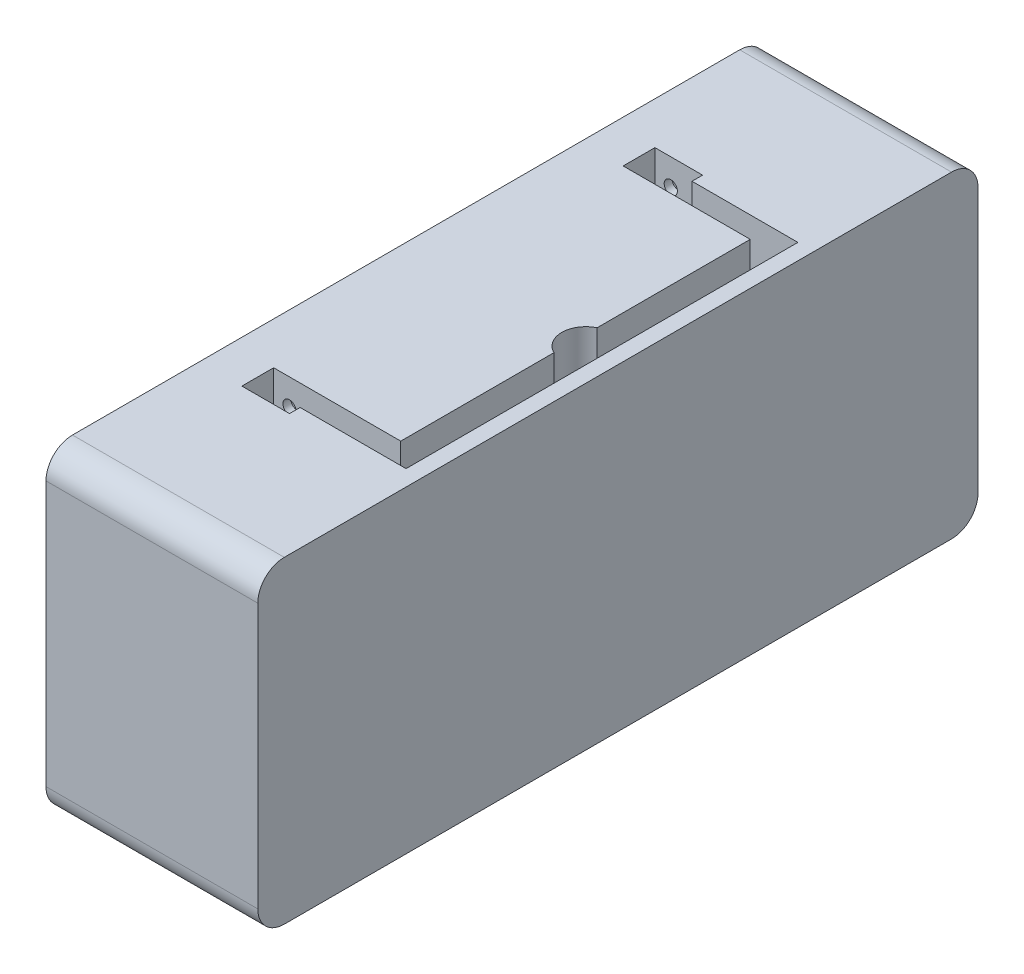
ISO-10303-21;
HEADER;
FILE_DESCRIPTION(('STEP AP214'),'2;1');
FILE_NAME('part.step','',(''),(''),'','','');
FILE_SCHEMA(('AUTOMOTIVE_DESIGN { 1 0 10303 214 1 1 1 1 }'));
ENDSEC;
DATA;
#1=APPLICATION_CONTEXT('core data for automotive mechanical design processes');
#2=APPLICATION_PROTOCOL_DEFINITION('international standard','automotive_design',2000,#1);
#3=PRODUCT_CONTEXT('',#1,'mechanical');
#4=PRODUCT('Part','Part','',(#3));
#5=PRODUCT_RELATED_PRODUCT_CATEGORY('part','',(#4));
#6=PRODUCT_DEFINITION_FORMATION('','',#4);
#7=PRODUCT_DEFINITION_CONTEXT('part definition',#1,'design');
#8=PRODUCT_DEFINITION('design','',#6,#7);
#9=PRODUCT_DEFINITION_SHAPE('','',#8);
#10=(LENGTH_UNIT() NAMED_UNIT(*) SI_UNIT(.MILLI.,.METRE.));
#11=(NAMED_UNIT(*) PLANE_ANGLE_UNIT() SI_UNIT($,.RADIAN.));
#12=(NAMED_UNIT(*) SI_UNIT($,.STERADIAN.) SOLID_ANGLE_UNIT());
#13=UNCERTAINTY_MEASURE_WITH_UNIT(LENGTH_MEASURE(1.E-05),#10,'distance_accuracy_value','');
#14=(GEOMETRIC_REPRESENTATION_CONTEXT(3) GLOBAL_UNCERTAINTY_ASSIGNED_CONTEXT((#13)) GLOBAL_UNIT_ASSIGNED_CONTEXT((#10,
#11,#12)) REPRESENTATION_CONTEXT('',''));
#15=CARTESIAN_POINT('',(0.,0.,0.));
#16=DIRECTION('',(0.,0.,1.));
#17=DIRECTION('',(1.,0.,0.));
#18=AXIS2_PLACEMENT_3D('',#15,#16,#17);
#19=CARTESIAN_POINT('',(-40.,25.,63.));
#20=DIRECTION('',(1.,0.,0.));
#21=DIRECTION('',(0.,0.,-1.));
#22=AXIS2_PLACEMENT_3D('',#19,#20,#21);
#23=CYLINDRICAL_SURFACE('',#22,5.);
#24=CARTESIAN_POINT('',(0.,25.,63.));
#25=DIRECTION('',(-1.,0.,0.));
#26=DIRECTION('',(0.,0.,1.));
#27=AXIS2_PLACEMENT_3D('',#24,#25,#26);
#28=CIRCLE('',#27,5.);
#29=CARTESIAN_POINT('',(0.,25.,68.));
#30=VERTEX_POINT('',#29);
#31=CARTESIAN_POINT('',(0.,30.,63.));
#32=VERTEX_POINT('',#31);
#33=EDGE_CURVE('E144',#30,#32,#28,.T.);
#34=ORIENTED_EDGE('',*,*,#33,.T.);
#35=DIRECTION('',(1.,0.,0.));
#36=VECTOR('',#35,1.);
#37=CARTESIAN_POINT('',(-40.,30.,63.));
#38=LINE('',#37,#36);
#39=CARTESIAN_POINT('',(-40.,30.,63.));
#40=VERTEX_POINT('',#39);
#41=EDGE_CURVE('E11',#40,#32,#38,.T.);
#42=ORIENTED_EDGE('',*,*,#41,.F.);
#43=CARTESIAN_POINT('',(-40.,25.,63.));
#44=DIRECTION('',(-1.,0.,0.));
#45=DIRECTION('',(0.,0.,1.));
#46=AXIS2_PLACEMENT_3D('',#43,#44,#45);
#47=CIRCLE('',#46,5.);
#48=CARTESIAN_POINT('',(-40.,25.,68.));
#49=VERTEX_POINT('',#48);
#50=EDGE_CURVE('E163',#49,#40,#47,.T.);
#51=ORIENTED_EDGE('',*,*,#50,.F.);
#52=DIRECTION('',(1.,0.,0.));
#53=VECTOR('',#52,1.);
#54=CARTESIAN_POINT('',(-40.,25.,68.));
#55=LINE('',#54,#53);
#56=EDGE_CURVE('E143',#49,#30,#55,.T.);
#57=ORIENTED_EDGE('',*,*,#56,.T.);
#58=EDGE_LOOP('',(#34,#42,#51,#57));
#59=FACE_BOUND('',#58,.T.);
#60=ADVANCED_FACE('F32',(#59),#23,.T.);
#61=CARTESIAN_POINT('',(-40.,30.,63.));
#62=DIRECTION('',(0.,-1.,0.));
#63=DIRECTION('',(0.,0.,-1.));
#64=AXIS2_PLACEMENT_3D('',#61,#62,#63);
#65=PLANE('',#64);
#66=DIRECTION('',(0.,0.,-1.));
#67=VECTOR('',#66,1.);
#68=CARTESIAN_POINT('',(-23.0095533827089,30.,-37.));
#69=LINE('',#68,#67);
#70=CARTESIAN_POINT('',(-23.0095533827089,30.,-37.));
#71=VERTEX_POINT('',#70);
#72=CARTESIAN_POINT('',(-23.0095533827089,30.,-39.));
#73=VERTEX_POINT('',#72);
#74=EDGE_CURVE('E235',#71,#73,#69,.T.);
#75=ORIENTED_EDGE('',*,*,#74,.F.);
#76=DIRECTION('',(-1.,0.,0.));
#77=VECTOR('',#76,1.);
#78=CARTESIAN_POINT('',(-3.00955338270888,30.,-37.));
#79=LINE('',#78,#77);
#80=CARTESIAN_POINT('',(-3.00955338270888,30.,-37.));
#81=VERTEX_POINT('',#80);
#82=EDGE_CURVE('E48',#81,#71,#79,.T.);
#83=ORIENTED_EDGE('',*,*,#82,.F.);
#84=DIRECTION('',(0.,0.,-1.));
#85=VECTOR('',#84,1.);
#86=CARTESIAN_POINT('',(-3.00955338270888,30.,37.));
#87=LINE('',#86,#85);
#88=CARTESIAN_POINT('',(-3.00955338270888,30.,37.));
#89=VERTEX_POINT('',#88);
#90=EDGE_CURVE('E194',#89,#81,#87,.T.);
#91=ORIENTED_EDGE('',*,*,#90,.F.);
#92=DIRECTION('',(1.,0.,0.));
#93=VECTOR('',#92,1.);
#94=CARTESIAN_POINT('',(-3.00955338270888,30.,37.));
#95=LINE('',#94,#93);
#96=CARTESIAN_POINT('',(-23.0095533827089,30.,37.));
#97=VERTEX_POINT('',#96);
#98=EDGE_CURVE('E268',#97,#89,#95,.T.);
#99=ORIENTED_EDGE('',*,*,#98,.F.);
#100=DIRECTION('',(0.,0.,-1.));
#101=VECTOR('',#100,1.);
#102=CARTESIAN_POINT('',(-23.0095533827089,30.,37.));
#103=LINE('',#102,#101);
#104=CARTESIAN_POINT('',(-23.0095533827089,30.,39.));
#105=VERTEX_POINT('',#104);
#106=EDGE_CURVE('E265',#105,#97,#103,.T.);
#107=ORIENTED_EDGE('',*,*,#106,.F.);
#108=DIRECTION('',(1.,0.,0.));
#109=VECTOR('',#108,1.);
#110=CARTESIAN_POINT('',(-23.0095533827089,30.,39.));
#111=LINE('',#110,#109);
#112=CARTESIAN_POINT('',(-32.0095533827089,30.,39.));
#113=VERTEX_POINT('',#112);
#114=EDGE_CURVE('E262',#113,#105,#111,.T.);
#115=ORIENTED_EDGE('',*,*,#114,.F.);
#116=DIRECTION('',(0.,0.,1.));
#117=VECTOR('',#116,1.);
#118=CARTESIAN_POINT('',(-32.0095533827089,30.,39.));
#119=LINE('',#118,#117);
#120=CARTESIAN_POINT('',(-32.0095533827089,30.,33.));
#121=VERTEX_POINT('',#120);
#122=EDGE_CURVE('E259',#121,#113,#119,.T.);
#123=ORIENTED_EDGE('',*,*,#122,.F.);
#124=DIRECTION('',(-1.,0.,0.));
#125=VECTOR('',#124,1.);
#126=CARTESIAN_POINT('',(-32.0095533827089,30.,33.));
#127=LINE('',#126,#125);
#128=CARTESIAN_POINT('',(-8.00955338270889,30.,33.));
#129=VERTEX_POINT('',#128);
#130=EDGE_CURVE('E256',#129,#121,#127,.T.);
#131=ORIENTED_EDGE('',*,*,#130,.F.);
#132=DIRECTION('',(0.,0.,1.));
#133=VECTOR('',#132,1.);
#134=CARTESIAN_POINT('',(-8.00955338270889,30.,33.));
#135=LINE('',#134,#133);
#136=CARTESIAN_POINT('',(-8.00955338270889,30.,4.0673131844042));
#137=VERTEX_POINT('',#136);
#138=EDGE_CURVE('E253',#137,#129,#135,.T.);
#139=ORIENTED_EDGE('',*,*,#138,.F.);
#140=CARTESIAN_POINT('',(-6.08420576215518,30.,0.));
#141=DIRECTION('',(0.,1.,0.));
#142=DIRECTION('',(0.,0.,-1.));
#143=AXIS2_PLACEMENT_3D('',#140,#141,#142);
#144=CIRCLE('',#143,4.5);
#145=CARTESIAN_POINT('',(-8.00955338270889,30.,-4.06731318440419));
#146=VERTEX_POINT('',#145);
#147=EDGE_CURVE('E250',#146,#137,#144,.T.);
#148=ORIENTED_EDGE('',*,*,#147,.F.);
#149=DIRECTION('',(0.,0.,1.));
#150=VECTOR('',#149,1.);
#151=CARTESIAN_POINT('',(-8.00955338270889,30.,-33.));
#152=LINE('',#151,#150);
#153=CARTESIAN_POINT('',(-8.00955338270889,30.,-33.));
#154=VERTEX_POINT('',#153);
#155=EDGE_CURVE('E247',#154,#146,#152,.T.);
#156=ORIENTED_EDGE('',*,*,#155,.F.);
#157=DIRECTION('',(1.,0.,0.));
#158=VECTOR('',#157,1.);
#159=CARTESIAN_POINT('',(-32.0095533827089,30.,-33.));
#160=LINE('',#159,#158);
#161=CARTESIAN_POINT('',(-32.0095533827089,30.,-33.));
#162=VERTEX_POINT('',#161);
#163=EDGE_CURVE('E244',#162,#154,#160,.T.);
#164=ORIENTED_EDGE('',*,*,#163,.F.);
#165=DIRECTION('',(0.,0.,1.));
#166=VECTOR('',#165,1.);
#167=CARTESIAN_POINT('',(-32.0095533827089,30.,-39.));
#168=LINE('',#167,#166);
#169=CARTESIAN_POINT('',(-32.0095533827089,30.,-39.));
#170=VERTEX_POINT('',#169);
#171=EDGE_CURVE('E241',#170,#162,#168,.T.);
#172=ORIENTED_EDGE('',*,*,#171,.F.);
#173=DIRECTION('',(-1.,0.,0.));
#174=VECTOR('',#173,1.);
#175=CARTESIAN_POINT('',(-23.0095533827089,30.,-39.));
#176=LINE('',#175,#174);
#177=EDGE_CURVE('E238',#73,#170,#176,.T.);
#178=ORIENTED_EDGE('',*,*,#177,.F.);
#179=EDGE_LOOP('',(#75,#83,#91,#99,#107,#115,#123,#131,#139,#148,#156,#164,#172,#178));
#180=FACE_BOUND('',#179,.T.);
#181=DIRECTION('',(0.,0.,-1.));
#182=VECTOR('',#181,1.);
#183=CARTESIAN_POINT('',(0.,30.,63.));
#184=LINE('',#183,#182);
#185=CARTESIAN_POINT('',(0.,30.,-63.));
#186=VERTEX_POINT('',#185);
#187=EDGE_CURVE('E147',#32,#186,#184,.T.);
#188=ORIENTED_EDGE('',*,*,#187,.T.);
#189=DIRECTION('',(1.,0.,0.));
#190=VECTOR('',#189,1.);
#191=CARTESIAN_POINT('',(-40.,30.,-63.));
#192=LINE('',#191,#190);
#193=CARTESIAN_POINT('',(-40.,30.,-63.));
#194=VERTEX_POINT('',#193);
#195=EDGE_CURVE('E40',#194,#186,#192,.T.);
#196=ORIENTED_EDGE('',*,*,#195,.F.);
#197=DIRECTION('',(0.,0.,-1.));
#198=VECTOR('',#197,1.);
#199=CARTESIAN_POINT('',(-40.,30.,63.));
#200=LINE('',#199,#198);
#201=EDGE_CURVE('E98',#40,#194,#200,.T.);
#202=ORIENTED_EDGE('',*,*,#201,.F.);
#203=ORIENTED_EDGE('',*,*,#41,.T.);
#204=EDGE_LOOP('',(#188,#196,#202,#203));
#205=FACE_BOUND('',#204,.T.);
#206=ADVANCED_FACE('F338',(#180,#205),#65,.F.);
#207=CARTESIAN_POINT('',(-40.,25.,-63.));
#208=DIRECTION('',(1.,0.,0.));
#209=DIRECTION('',(0.,0.,-1.));
#210=AXIS2_PLACEMENT_3D('',#207,#208,#209);
#211=CYLINDRICAL_SURFACE('',#210,5.);
#212=CARTESIAN_POINT('',(0.,25.,-63.));
#213=DIRECTION('',(-1.,0.,0.));
#214=DIRECTION('',(0.,0.,1.));
#215=AXIS2_PLACEMENT_3D('',#212,#213,#214);
#216=CIRCLE('',#215,5.);
#217=CARTESIAN_POINT('',(0.,25.,-68.));
#218=VERTEX_POINT('',#217);
#219=EDGE_CURVE('E150',#186,#218,#216,.T.);
#220=ORIENTED_EDGE('',*,*,#219,.T.);
#221=DIRECTION('',(1.,0.,0.));
#222=VECTOR('',#221,1.);
#223=CARTESIAN_POINT('',(-40.,25.,-68.));
#224=LINE('',#223,#222);
#225=CARTESIAN_POINT('',(-40.,25.,-68.));
#226=VERTEX_POINT('',#225);
#227=EDGE_CURVE('E169',#226,#218,#224,.T.);
#228=ORIENTED_EDGE('',*,*,#227,.F.);
#229=CARTESIAN_POINT('',(-40.,25.,-63.));
#230=DIRECTION('',(-1.,0.,0.));
#231=DIRECTION('',(0.,0.,1.));
#232=AXIS2_PLACEMENT_3D('',#229,#230,#231);
#233=CIRCLE('',#232,5.);
#234=EDGE_CURVE('E313',#194,#226,#233,.T.);
#235=ORIENTED_EDGE('',*,*,#234,.F.);
#236=ORIENTED_EDGE('',*,*,#195,.T.);
#237=EDGE_LOOP('',(#220,#228,#235,#236));
#238=FACE_BOUND('',#237,.T.);
#239=ADVANCED_FACE('F321',(#238),#211,.T.);
#240=CARTESIAN_POINT('',(-40.,-25.,-68.));
#241=DIRECTION('',(0.,0.,-1.));
#242=DIRECTION('',(-1.,0.,0.));
#243=AXIS2_PLACEMENT_3D('',#240,#241,#242);
#244=PLANE('',#243);
#245=DIRECTION('',(0.,1.,0.));
#246=VECTOR('',#245,1.);
#247=CARTESIAN_POINT('',(0.,-25.,-68.));
#248=LINE('',#247,#246);
#249=CARTESIAN_POINT('',(0.,-25.,-68.));
#250=VERTEX_POINT('',#249);
#251=EDGE_CURVE('E153',#250,#218,#248,.T.);
#252=ORIENTED_EDGE('',*,*,#251,.F.);
#253=DIRECTION('',(1.,0.,0.));
#254=VECTOR('',#253,1.);
#255=CARTESIAN_POINT('',(-40.,-25.,-68.));
#256=LINE('',#255,#254);
#257=CARTESIAN_POINT('',(-40.,-25.,-68.));
#258=VERTEX_POINT('',#257);
#259=EDGE_CURVE('E167',#258,#250,#256,.T.);
#260=ORIENTED_EDGE('',*,*,#259,.F.);
#261=DIRECTION('',(0.,1.,0.));
#262=VECTOR('',#261,1.);
#263=CARTESIAN_POINT('',(-40.,-25.,-68.));
#264=LINE('',#263,#262);
#265=EDGE_CURVE('E138',#258,#226,#264,.T.);
#266=ORIENTED_EDGE('',*,*,#265,.T.);
#267=ORIENTED_EDGE('',*,*,#227,.T.);
#268=EDGE_LOOP('',(#252,#260,#266,#267));
#269=FACE_BOUND('',#268,.T.);
#270=ADVANCED_FACE('F317',(#269),#244,.T.);
#271=CARTESIAN_POINT('',(-40.,-25.,-63.));
#272=DIRECTION('',(1.,0.,0.));
#273=DIRECTION('',(0.,0.,-1.));
#274=AXIS2_PLACEMENT_3D('',#271,#272,#273);
#275=CYLINDRICAL_SURFACE('',#274,5.);
#276=CARTESIAN_POINT('',(0.,-25.,-63.));
#277=DIRECTION('',(-1.,0.,0.));
#278=DIRECTION('',(0.,0.,1.));
#279=AXIS2_PLACEMENT_3D('',#276,#277,#278);
#280=CIRCLE('',#279,5.);
#281=CARTESIAN_POINT('',(0.,-30.,-63.));
#282=VERTEX_POINT('',#281);
#283=EDGE_CURVE('E156',#250,#282,#280,.T.);
#284=ORIENTED_EDGE('',*,*,#283,.T.);
#285=DIRECTION('',(1.,0.,0.));
#286=VECTOR('',#285,1.);
#287=CARTESIAN_POINT('',(-40.,-30.,-63.));
#288=LINE('',#287,#286);
#289=CARTESIAN_POINT('',(-40.,-30.,-63.));
#290=VERTEX_POINT('',#289);
#291=EDGE_CURVE('E125',#290,#282,#288,.T.);
#292=ORIENTED_EDGE('',*,*,#291,.F.);
#293=CARTESIAN_POINT('',(-40.,-25.,-63.));
#294=DIRECTION('',(-1.,0.,0.));
#295=DIRECTION('',(0.,0.,1.));
#296=AXIS2_PLACEMENT_3D('',#293,#294,#295);
#297=CIRCLE('',#296,5.);
#298=EDGE_CURVE('E135',#258,#290,#297,.T.);
#299=ORIENTED_EDGE('',*,*,#298,.F.);
#300=ORIENTED_EDGE('',*,*,#259,.T.);
#301=EDGE_LOOP('',(#284,#292,#299,#300));
#302=FACE_BOUND('',#301,.T.);
#303=ADVANCED_FACE('F328',(#302),#275,.T.);
#304=CARTESIAN_POINT('',(-40.,-30.,63.));
#305=DIRECTION('',(0.,-1.,0.));
#306=DIRECTION('',(0.,0.,-1.));
#307=AXIS2_PLACEMENT_3D('',#304,#305,#306);
#308=PLANE('',#307);
#309=DIRECTION('',(0.,0.,-1.));
#310=VECTOR('',#309,1.);
#311=CARTESIAN_POINT('',(0.,-30.,63.));
#312=LINE('',#311,#310);
#313=CARTESIAN_POINT('',(0.,-30.,63.));
#314=VERTEX_POINT('',#313);
#315=EDGE_CURVE('E122',#314,#282,#312,.T.);
#316=ORIENTED_EDGE('',*,*,#315,.F.);
#317=DIRECTION('',(1.,0.,0.));
#318=VECTOR('',#317,1.);
#319=CARTESIAN_POINT('',(-40.,-30.,63.));
#320=LINE('',#319,#318);
#321=CARTESIAN_POINT('',(-40.,-30.,63.));
#322=VERTEX_POINT('',#321);
#323=EDGE_CURVE('E116',#322,#314,#320,.T.);
#324=ORIENTED_EDGE('',*,*,#323,.F.);
#325=DIRECTION('',(0.,0.,-1.));
#326=VECTOR('',#325,1.);
#327=CARTESIAN_POINT('',(-40.,-30.,63.));
#328=LINE('',#327,#326);
#329=EDGE_CURVE('E120',#322,#290,#328,.T.);
#330=ORIENTED_EDGE('',*,*,#329,.T.);
#331=ORIENTED_EDGE('',*,*,#291,.T.);
#332=EDGE_LOOP('',(#316,#324,#330,#331));
#333=FACE_BOUND('',#332,.T.);
#334=ADVANCED_FACE('F118',(#333),#308,.T.);
#335=CARTESIAN_POINT('',(-40.,-25.,63.));
#336=DIRECTION('',(1.,0.,0.));
#337=DIRECTION('',(0.,0.,-1.));
#338=AXIS2_PLACEMENT_3D('',#335,#336,#337);
#339=CYLINDRICAL_SURFACE('',#338,5.);
#340=CARTESIAN_POINT('',(0.,-25.,63.));
#341=DIRECTION('',(-1.,0.,0.));
#342=DIRECTION('',(0.,0.,1.));
#343=AXIS2_PLACEMENT_3D('',#340,#341,#342);
#344=CIRCLE('',#343,5.);
#345=CARTESIAN_POINT('',(0.,-25.,68.));
#346=VERTEX_POINT('',#345);
#347=EDGE_CURVE('E160',#314,#346,#344,.T.);
#348=ORIENTED_EDGE('',*,*,#347,.T.);
#349=DIRECTION('',(1.,0.,0.));
#350=VECTOR('',#349,1.);
#351=CARTESIAN_POINT('',(-40.,-25.,68.));
#352=LINE('',#351,#350);
#353=CARTESIAN_POINT('',(-40.,-25.,68.));
#354=VERTEX_POINT('',#353);
#355=EDGE_CURVE('E126',#354,#346,#352,.T.);
#356=ORIENTED_EDGE('',*,*,#355,.F.);
#357=CARTESIAN_POINT('',(-40.,-25.,63.));
#358=DIRECTION('',(-1.,0.,0.));
#359=DIRECTION('',(0.,0.,1.));
#360=AXIS2_PLACEMENT_3D('',#357,#358,#359);
#361=CIRCLE('',#360,5.);
#362=EDGE_CURVE('E129',#322,#354,#361,.T.);
#363=ORIENTED_EDGE('',*,*,#362,.F.);
#364=ORIENTED_EDGE('',*,*,#323,.T.);
#365=EDGE_LOOP('',(#348,#356,#363,#364));
#366=FACE_BOUND('',#365,.T.);
#367=ADVANCED_FACE('F130',(#366),#339,.T.);
#368=CARTESIAN_POINT('',(-40.,-25.,68.));
#369=DIRECTION('',(0.,0.,-1.));
#370=DIRECTION('',(-1.,0.,0.));
#371=AXIS2_PLACEMENT_3D('',#368,#369,#370);
#372=PLANE('',#371);
#373=DIRECTION('',(0.,1.,0.));
#374=VECTOR('',#373,1.);
#375=CARTESIAN_POINT('',(0.,-25.,68.));
#376=LINE('',#375,#374);
#377=EDGE_CURVE('E90',#346,#30,#376,.T.);
#378=ORIENTED_EDGE('',*,*,#377,.T.);
#379=ORIENTED_EDGE('',*,*,#56,.F.);
#380=DIRECTION('',(0.,1.,0.));
#381=VECTOR('',#380,1.);
#382=CARTESIAN_POINT('',(-40.,-25.,68.));
#383=LINE('',#382,#381);
#384=EDGE_CURVE('E57',#354,#49,#383,.T.);
#385=ORIENTED_EDGE('',*,*,#384,.F.);
#386=ORIENTED_EDGE('',*,*,#355,.T.);
#387=EDGE_LOOP('',(#378,#379,#385,#386));
#388=FACE_BOUND('',#387,.T.);
#389=ADVANCED_FACE('F346',(#388),#372,.F.);
#390=CARTESIAN_POINT('',(-40.,25.,63.));
#391=DIRECTION('',(-1.,0.,0.));
#392=DIRECTION('',(0.,0.,1.));
#393=AXIS2_PLACEMENT_3D('',#390,#391,#392);
#394=PLANE('',#393);
#395=ORIENTED_EDGE('',*,*,#50,.T.);
#396=ORIENTED_EDGE('',*,*,#201,.T.);
#397=ORIENTED_EDGE('',*,*,#234,.T.);
#398=ORIENTED_EDGE('',*,*,#265,.F.);
#399=ORIENTED_EDGE('',*,*,#298,.T.);
#400=ORIENTED_EDGE('',*,*,#329,.F.);
#401=ORIENTED_EDGE('',*,*,#362,.T.);
#402=ORIENTED_EDGE('',*,*,#384,.T.);
#403=EDGE_LOOP('',(#395,#396,#397,#398,#399,#400,#401,#402));
#404=FACE_BOUND('',#403,.T.);
#405=ADVANCED_FACE('F132',(#404),#394,.T.);
#406=CARTESIAN_POINT('',(0.,25.,63.));
#407=DIRECTION('',(-1.,0.,0.));
#408=DIRECTION('',(0.,0.,1.));
#409=AXIS2_PLACEMENT_3D('',#406,#407,#408);
#410=PLANE('',#409);
#411=ORIENTED_EDGE('',*,*,#33,.F.);
#412=ORIENTED_EDGE('',*,*,#377,.F.);
#413=ORIENTED_EDGE('',*,*,#347,.F.);
#414=ORIENTED_EDGE('',*,*,#315,.T.);
#415=ORIENTED_EDGE('',*,*,#283,.F.);
#416=ORIENTED_EDGE('',*,*,#251,.T.);
#417=ORIENTED_EDGE('',*,*,#219,.F.);
#418=ORIENTED_EDGE('',*,*,#187,.F.);
#419=EDGE_LOOP('',(#411,#412,#413,#414,#415,#416,#417,#418));
#420=FACE_BOUND('',#419,.T.);
#421=ADVANCED_FACE('F326',(#420),#410,.F.);
#422=CARTESIAN_POINT('',(-3.00955338270888,20.,-37.));
#423=DIRECTION('',(0.,0.,-1.));
#424=DIRECTION('',(-1.,0.,0.));
#425=AXIS2_PLACEMENT_3D('',#422,#423,#424);
#426=PLANE('',#425);
#427=ORIENTED_EDGE('',*,*,#82,.T.);
#428=DIRECTION('',(0.,1.,0.));
#429=VECTOR('',#428,1.);
#430=CARTESIAN_POINT('',(-23.0095533827089,20.,-37.));
#431=LINE('',#430,#429);
#432=CARTESIAN_POINT('',(-23.0095533827089,20.,-37.));
#433=VERTEX_POINT('',#432);
#434=EDGE_CURVE('E233',#433,#71,#431,.T.);
#435=ORIENTED_EDGE('',*,*,#434,.F.);
#436=DIRECTION('',(-1.,0.,0.));
#437=VECTOR('',#436,1.);
#438=CARTESIAN_POINT('',(-3.00955338270888,20.,-37.));
#439=LINE('',#438,#437);
#440=CARTESIAN_POINT('',(-3.00955338270888,20.,-37.));
#441=VERTEX_POINT('',#440);
#442=EDGE_CURVE('E190',#441,#433,#439,.T.);
#443=ORIENTED_EDGE('',*,*,#442,.F.);
#444=DIRECTION('',(0.,1.,0.));
#445=VECTOR('',#444,1.);
#446=CARTESIAN_POINT('',(-3.00955338270888,20.,-37.));
#447=LINE('',#446,#445);
#448=EDGE_CURVE('E148',#441,#81,#447,.T.);
#449=ORIENTED_EDGE('',*,*,#448,.T.);
#450=EDGE_LOOP('',(#427,#435,#443,#449));
#451=FACE_BOUND('',#450,.T.);
#452=ADVANCED_FACE('F357',(#451),#426,.F.);
#453=CARTESIAN_POINT('',(-3.00955338270888,20.,37.));
#454=DIRECTION('',(1.,0.,0.));
#455=DIRECTION('',(0.,0.,-1.));
#456=AXIS2_PLACEMENT_3D('',#453,#454,#455);
#457=PLANE('',#456);
#458=ORIENTED_EDGE('',*,*,#90,.T.);
#459=ORIENTED_EDGE('',*,*,#448,.F.);
#460=DIRECTION('',(0.,0.,-1.));
#461=VECTOR('',#460,1.);
#462=CARTESIAN_POINT('',(-3.00955338270888,20.,37.));
#463=LINE('',#462,#461);
#464=CARTESIAN_POINT('',(-3.00955338270888,20.,37.));
#465=VERTEX_POINT('',#464);
#466=EDGE_CURVE('E230',#465,#441,#463,.T.);
#467=ORIENTED_EDGE('',*,*,#466,.F.);
#468=DIRECTION('',(0.,1.,0.));
#469=VECTOR('',#468,1.);
#470=CARTESIAN_POINT('',(-3.00955338270888,20.,37.));
#471=LINE('',#470,#469);
#472=EDGE_CURVE('E274',#465,#89,#471,.T.);
#473=ORIENTED_EDGE('',*,*,#472,.T.);
#474=EDGE_LOOP('',(#458,#459,#467,#473));
#475=FACE_BOUND('',#474,.T.);
#476=ADVANCED_FACE('F361',(#475),#457,.F.);
#477=CARTESIAN_POINT('',(-3.00955338270888,20.,37.));
#478=DIRECTION('',(0.,0.,1.));
#479=DIRECTION('',(1.,0.,0.));
#480=AXIS2_PLACEMENT_3D('',#477,#478,#479);
#481=PLANE('',#480);
#482=ORIENTED_EDGE('',*,*,#98,.T.);
#483=ORIENTED_EDGE('',*,*,#472,.F.);
#484=DIRECTION('',(1.,0.,0.));
#485=VECTOR('',#484,1.);
#486=CARTESIAN_POINT('',(-3.00955338270888,20.,37.));
#487=LINE('',#486,#485);
#488=CARTESIAN_POINT('',(-23.0095533827089,20.,37.));
#489=VERTEX_POINT('',#488);
#490=EDGE_CURVE('E227',#489,#465,#487,.T.);
#491=ORIENTED_EDGE('',*,*,#490,.F.);
#492=DIRECTION('',(0.,1.,0.));
#493=VECTOR('',#492,1.);
#494=CARTESIAN_POINT('',(-23.0095533827089,20.,37.));
#495=LINE('',#494,#493);
#496=EDGE_CURVE('E277',#489,#97,#495,.T.);
#497=ORIENTED_EDGE('',*,*,#496,.T.);
#498=EDGE_LOOP('',(#482,#483,#491,#497));
#499=FACE_BOUND('',#498,.T.);
#500=ADVANCED_FACE('F406',(#499),#481,.F.);
#501=CARTESIAN_POINT('',(-23.0095533827089,20.,37.));
#502=DIRECTION('',(1.,0.,0.));
#503=DIRECTION('',(0.,0.,-1.));
#504=AXIS2_PLACEMENT_3D('',#501,#502,#503);
#505=PLANE('',#504);
#506=ORIENTED_EDGE('',*,*,#106,.T.);
#507=ORIENTED_EDGE('',*,*,#496,.F.);
#508=DIRECTION('',(0.,0.,-1.));
#509=VECTOR('',#508,1.);
#510=CARTESIAN_POINT('',(-23.0095533827089,20.,37.));
#511=LINE('',#510,#509);
#512=CARTESIAN_POINT('',(-23.0095533827089,20.,39.));
#513=VERTEX_POINT('',#512);
#514=EDGE_CURVE('E224',#513,#489,#511,.T.);
#515=ORIENTED_EDGE('',*,*,#514,.F.);
#516=DIRECTION('',(0.,1.,0.));
#517=VECTOR('',#516,1.);
#518=CARTESIAN_POINT('',(-23.0095533827089,20.,39.));
#519=LINE('',#518,#517);
#520=EDGE_CURVE('E280',#513,#105,#519,.T.);
#521=ORIENTED_EDGE('',*,*,#520,.T.);
#522=EDGE_LOOP('',(#506,#507,#515,#521));
#523=FACE_BOUND('',#522,.T.);
#524=ADVANCED_FACE('F402',(#523),#505,.F.);
#525=CARTESIAN_POINT('',(-23.0095533827089,20.,39.));
#526=DIRECTION('',(0.,0.,1.));
#527=DIRECTION('',(1.,0.,0.));
#528=AXIS2_PLACEMENT_3D('',#525,#526,#527);
#529=PLANE('',#528);
#530=CARTESIAN_POINT('',(-29.012566775344,25.,39.));
#531=DIRECTION('',(0.,0.,1.));
#532=DIRECTION('',(1.,0.,0.));
#533=AXIS2_PLACEMENT_3D('',#530,#531,#532);
#534=CIRCLE('',#533,1.25);
#535=CARTESIAN_POINT('',(-27.762566775344,25.,39.));
#536=VERTEX_POINT('',#535);
#537=EDGE_CURVE('E186',#536,#536,#534,.T.);
#538=ORIENTED_EDGE('',*,*,#537,.T.);
#539=EDGE_LOOP('',(#538));
#540=FACE_BOUND('',#539,.T.);
#541=ORIENTED_EDGE('',*,*,#114,.T.);
#542=ORIENTED_EDGE('',*,*,#520,.F.);
#543=DIRECTION('',(1.,0.,0.));
#544=VECTOR('',#543,1.);
#545=CARTESIAN_POINT('',(-23.0095533827089,20.,39.));
#546=LINE('',#545,#544);
#547=CARTESIAN_POINT('',(-32.0095533827089,20.,39.));
#548=VERTEX_POINT('',#547);
#549=EDGE_CURVE('E221',#548,#513,#546,.T.);
#550=ORIENTED_EDGE('',*,*,#549,.F.);
#551=DIRECTION('',(0.,1.,0.));
#552=VECTOR('',#551,1.);
#553=CARTESIAN_POINT('',(-32.0095533827089,20.,39.));
#554=LINE('',#553,#552);
#555=EDGE_CURVE('E283',#548,#113,#554,.T.);
#556=ORIENTED_EDGE('',*,*,#555,.T.);
#557=EDGE_LOOP('',(#541,#542,#550,#556));
#558=FACE_BOUND('',#557,.T.);
#559=ADVANCED_FACE('F398',(#540,#558),#529,.F.);
#560=CARTESIAN_POINT('',(-32.0095533827089,20.,39.));
#561=DIRECTION('',(-1.,0.,0.));
#562=DIRECTION('',(0.,0.,1.));
#563=AXIS2_PLACEMENT_3D('',#560,#561,#562);
#564=PLANE('',#563);
#565=ORIENTED_EDGE('',*,*,#122,.T.);
#566=ORIENTED_EDGE('',*,*,#555,.F.);
#567=DIRECTION('',(0.,0.,1.));
#568=VECTOR('',#567,1.);
#569=CARTESIAN_POINT('',(-32.0095533827089,20.,39.));
#570=LINE('',#569,#568);
#571=CARTESIAN_POINT('',(-32.0095533827089,20.,33.));
#572=VERTEX_POINT('',#571);
#573=EDGE_CURVE('E218',#572,#548,#570,.T.);
#574=ORIENTED_EDGE('',*,*,#573,.F.);
#575=DIRECTION('',(0.,1.,0.));
#576=VECTOR('',#575,1.);
#577=CARTESIAN_POINT('',(-32.0095533827089,20.,33.));
#578=LINE('',#577,#576);
#579=EDGE_CURVE('E286',#572,#121,#578,.T.);
#580=ORIENTED_EDGE('',*,*,#579,.T.);
#581=EDGE_LOOP('',(#565,#566,#574,#580));
#582=FACE_BOUND('',#581,.T.);
#583=ADVANCED_FACE('F394',(#582),#564,.F.);
#584=CARTESIAN_POINT('',(-32.0095533827089,20.,33.));
#585=DIRECTION('',(0.,0.,-1.));
#586=DIRECTION('',(-1.,0.,0.));
#587=AXIS2_PLACEMENT_3D('',#584,#585,#586);
#588=PLANE('',#587);
#589=CARTESIAN_POINT('',(-29.012566775344,25.,33.));
#590=DIRECTION('',(0.,0.,-1.));
#591=DIRECTION('',(-1.,0.,0.));
#592=AXIS2_PLACEMENT_3D('',#589,#590,#591);
#593=CIRCLE('',#592,1.25);
#594=CARTESIAN_POINT('',(-30.262566775344,25.,33.));
#595=VERTEX_POINT('',#594);
#596=EDGE_CURVE('E35',#595,#595,#593,.T.);
#597=ORIENTED_EDGE('',*,*,#596,.T.);
#598=EDGE_LOOP('',(#597));
#599=FACE_BOUND('',#598,.T.);
#600=ORIENTED_EDGE('',*,*,#130,.T.);
#601=ORIENTED_EDGE('',*,*,#579,.F.);
#602=DIRECTION('',(-1.,0.,0.));
#603=VECTOR('',#602,1.);
#604=CARTESIAN_POINT('',(-32.0095533827089,20.,33.));
#605=LINE('',#604,#603);
#606=CARTESIAN_POINT('',(-8.00955338270889,20.,33.));
#607=VERTEX_POINT('',#606);
#608=EDGE_CURVE('E215',#607,#572,#605,.T.);
#609=ORIENTED_EDGE('',*,*,#608,.F.);
#610=DIRECTION('',(0.,1.,0.));
#611=VECTOR('',#610,1.);
#612=CARTESIAN_POINT('',(-8.00955338270889,20.,33.));
#613=LINE('',#612,#611);
#614=EDGE_CURVE('E289',#607,#129,#613,.T.);
#615=ORIENTED_EDGE('',*,*,#614,.T.);
#616=EDGE_LOOP('',(#600,#601,#609,#615));
#617=FACE_BOUND('',#616,.T.);
#618=ADVANCED_FACE('F390',(#599,#617),#588,.F.);
#619=CARTESIAN_POINT('',(-8.00955338270889,20.,33.));
#620=DIRECTION('',(-1.,0.,0.));
#621=DIRECTION('',(0.,0.,1.));
#622=AXIS2_PLACEMENT_3D('',#619,#620,#621);
#623=PLANE('',#622);
#624=ORIENTED_EDGE('',*,*,#138,.T.);
#625=ORIENTED_EDGE('',*,*,#614,.F.);
#626=DIRECTION('',(0.,0.,1.));
#627=VECTOR('',#626,1.);
#628=CARTESIAN_POINT('',(-8.00955338270889,20.,33.));
#629=LINE('',#628,#627);
#630=CARTESIAN_POINT('',(-8.00955338270889,20.,4.0673131844042));
#631=VERTEX_POINT('',#630);
#632=EDGE_CURVE('E212',#631,#607,#629,.T.);
#633=ORIENTED_EDGE('',*,*,#632,.F.);
#634=DIRECTION('',(0.,1.,0.));
#635=VECTOR('',#634,1.);
#636=CARTESIAN_POINT('',(-8.00955338270889,20.,4.0673131844042));
#637=LINE('',#636,#635);
#638=EDGE_CURVE('E292',#631,#137,#637,.T.);
#639=ORIENTED_EDGE('',*,*,#638,.T.);
#640=EDGE_LOOP('',(#624,#625,#633,#639));
#641=FACE_BOUND('',#640,.T.);
#642=ADVANCED_FACE('F386',(#641),#623,.F.);
#643=CARTESIAN_POINT('',(-6.08420576215518,20.,0.));
#644=DIRECTION('',(0.,1.,0.));
#645=DIRECTION('',(0.,0.,1.));
#646=AXIS2_PLACEMENT_3D('',#643,#644,#645);
#647=CYLINDRICAL_SURFACE('',#646,4.5);
#648=ORIENTED_EDGE('',*,*,#147,.T.);
#649=ORIENTED_EDGE('',*,*,#638,.F.);
#650=CARTESIAN_POINT('',(-6.08420576215518,20.,0.));
#651=DIRECTION('',(0.,1.,0.));
#652=DIRECTION('',(0.,0.,-1.));
#653=AXIS2_PLACEMENT_3D('',#650,#651,#652);
#654=CIRCLE('',#653,4.5);
#655=CARTESIAN_POINT('',(-8.00955338270889,20.,-4.06731318440419));
#656=VERTEX_POINT('',#655);
#657=EDGE_CURVE('E209',#656,#631,#654,.T.);
#658=ORIENTED_EDGE('',*,*,#657,.F.);
#659=DIRECTION('',(0.,1.,0.));
#660=VECTOR('',#659,1.);
#661=CARTESIAN_POINT('',(-8.00955338270889,20.,-4.06731318440419));
#662=LINE('',#661,#660);
#663=EDGE_CURVE('E295',#656,#146,#662,.T.);
#664=ORIENTED_EDGE('',*,*,#663,.T.);
#665=EDGE_LOOP('',(#648,#649,#658,#664));
#666=FACE_BOUND('',#665,.T.);
#667=ADVANCED_FACE('F382',(#666),#647,.F.);
#668=CARTESIAN_POINT('',(-8.00955338270889,20.,-33.));
#669=DIRECTION('',(-1.,0.,0.));
#670=DIRECTION('',(0.,0.,1.));
#671=AXIS2_PLACEMENT_3D('',#668,#669,#670);
#672=PLANE('',#671);
#673=ORIENTED_EDGE('',*,*,#155,.T.);
#674=ORIENTED_EDGE('',*,*,#663,.F.);
#675=DIRECTION('',(0.,0.,1.));
#676=VECTOR('',#675,1.);
#677=CARTESIAN_POINT('',(-8.00955338270889,20.,-33.));
#678=LINE('',#677,#676);
#679=CARTESIAN_POINT('',(-8.00955338270889,20.,-33.));
#680=VERTEX_POINT('',#679);
#681=EDGE_CURVE('E206',#680,#656,#678,.T.);
#682=ORIENTED_EDGE('',*,*,#681,.F.);
#683=DIRECTION('',(0.,1.,0.));
#684=VECTOR('',#683,1.);
#685=CARTESIAN_POINT('',(-8.00955338270889,20.,-33.));
#686=LINE('',#685,#684);
#687=EDGE_CURVE('E298',#680,#154,#686,.T.);
#688=ORIENTED_EDGE('',*,*,#687,.T.);
#689=EDGE_LOOP('',(#673,#674,#682,#688));
#690=FACE_BOUND('',#689,.T.);
#691=ADVANCED_FACE('F378',(#690),#672,.F.);
#692=CARTESIAN_POINT('',(-32.0095533827089,20.,-33.));
#693=DIRECTION('',(0.,0.,1.));
#694=DIRECTION('',(1.,0.,0.));
#695=AXIS2_PLACEMENT_3D('',#692,#693,#694);
#696=PLANE('',#695);
#697=CARTESIAN_POINT('',(-29.012566775344,25.,-33.));
#698=DIRECTION('',(0.,0.,1.));
#699=DIRECTION('',(1.,0.,0.));
#700=AXIS2_PLACEMENT_3D('',#697,#698,#699);
#701=CIRCLE('',#700,1.25);
#702=CARTESIAN_POINT('',(-27.762566775344,25.,-33.));
#703=VERTEX_POINT('',#702);
#704=EDGE_CURVE('E174',#703,#703,#701,.F.);
#705=ORIENTED_EDGE('',*,*,#704,.F.);
#706=EDGE_LOOP('',(#705));
#707=FACE_BOUND('',#706,.T.);
#708=ORIENTED_EDGE('',*,*,#163,.T.);
#709=ORIENTED_EDGE('',*,*,#687,.F.);
#710=DIRECTION('',(1.,0.,0.));
#711=VECTOR('',#710,1.);
#712=CARTESIAN_POINT('',(-32.0095533827089,20.,-33.));
#713=LINE('',#712,#711);
#714=CARTESIAN_POINT('',(-32.0095533827089,20.,-33.));
#715=VERTEX_POINT('',#714);
#716=EDGE_CURVE('E203',#715,#680,#713,.T.);
#717=ORIENTED_EDGE('',*,*,#716,.F.);
#718=DIRECTION('',(0.,1.,0.));
#719=VECTOR('',#718,1.);
#720=CARTESIAN_POINT('',(-32.0095533827089,20.,-33.));
#721=LINE('',#720,#719);
#722=EDGE_CURVE('E301',#715,#162,#721,.T.);
#723=ORIENTED_EDGE('',*,*,#722,.T.);
#724=EDGE_LOOP('',(#708,#709,#717,#723));
#725=FACE_BOUND('',#724,.T.);
#726=ADVANCED_FACE('F374',(#707,#725),#696,.F.);
#727=CARTESIAN_POINT('',(-32.0095533827089,20.,-39.));
#728=DIRECTION('',(-1.,0.,0.));
#729=DIRECTION('',(0.,0.,1.));
#730=AXIS2_PLACEMENT_3D('',#727,#728,#729);
#731=PLANE('',#730);
#732=ORIENTED_EDGE('',*,*,#171,.T.);
#733=ORIENTED_EDGE('',*,*,#722,.F.);
#734=DIRECTION('',(0.,0.,1.));
#735=VECTOR('',#734,1.);
#736=CARTESIAN_POINT('',(-32.0095533827089,20.,-39.));
#737=LINE('',#736,#735);
#738=CARTESIAN_POINT('',(-32.0095533827089,20.,-39.));
#739=VERTEX_POINT('',#738);
#740=EDGE_CURVE('E200',#739,#715,#737,.T.);
#741=ORIENTED_EDGE('',*,*,#740,.F.);
#742=DIRECTION('',(0.,1.,0.));
#743=VECTOR('',#742,1.);
#744=CARTESIAN_POINT('',(-32.0095533827089,20.,-39.));
#745=LINE('',#744,#743);
#746=EDGE_CURVE('E304',#739,#170,#745,.T.);
#747=ORIENTED_EDGE('',*,*,#746,.T.);
#748=EDGE_LOOP('',(#732,#733,#741,#747));
#749=FACE_BOUND('',#748,.T.);
#750=ADVANCED_FACE('F370',(#749),#731,.F.);
#751=CARTESIAN_POINT('',(-23.0095533827089,20.,-39.));
#752=DIRECTION('',(0.,0.,-1.));
#753=DIRECTION('',(-1.,0.,0.));
#754=AXIS2_PLACEMENT_3D('',#751,#752,#753);
#755=PLANE('',#754);
#756=CARTESIAN_POINT('',(-29.012566775344,25.,-39.));
#757=DIRECTION('',(0.,0.,-1.));
#758=DIRECTION('',(-1.,0.,0.));
#759=AXIS2_PLACEMENT_3D('',#756,#757,#758);
#760=CIRCLE('',#759,1.25);
#761=CARTESIAN_POINT('',(-30.262566775344,25.,-39.));
#762=VERTEX_POINT('',#761);
#763=EDGE_CURVE('E172',#762,#762,#760,.F.);
#764=ORIENTED_EDGE('',*,*,#763,.F.);
#765=EDGE_LOOP('',(#764));
#766=FACE_BOUND('',#765,.T.);
#767=ORIENTED_EDGE('',*,*,#177,.T.);
#768=ORIENTED_EDGE('',*,*,#746,.F.);
#769=DIRECTION('',(-1.,0.,0.));
#770=VECTOR('',#769,1.);
#771=CARTESIAN_POINT('',(-23.0095533827089,20.,-39.));
#772=LINE('',#771,#770);
#773=CARTESIAN_POINT('',(-23.0095533827089,20.,-39.));
#774=VERTEX_POINT('',#773);
#775=EDGE_CURVE('E197',#774,#739,#772,.T.);
#776=ORIENTED_EDGE('',*,*,#775,.F.);
#777=DIRECTION('',(0.,1.,0.));
#778=VECTOR('',#777,1.);
#779=CARTESIAN_POINT('',(-23.0095533827089,20.,-39.));
#780=LINE('',#779,#778);
#781=EDGE_CURVE('E307',#774,#73,#780,.T.);
#782=ORIENTED_EDGE('',*,*,#781,.T.);
#783=EDGE_LOOP('',(#767,#768,#776,#782));
#784=FACE_BOUND('',#783,.T.);
#785=ADVANCED_FACE('F366',(#766,#784),#755,.F.);
#786=CARTESIAN_POINT('',(-23.0095533827089,20.,-37.));
#787=DIRECTION('',(1.,0.,0.));
#788=DIRECTION('',(0.,0.,-1.));
#789=AXIS2_PLACEMENT_3D('',#786,#787,#788);
#790=PLANE('',#789);
#791=ORIENTED_EDGE('',*,*,#74,.T.);
#792=ORIENTED_EDGE('',*,*,#781,.F.);
#793=DIRECTION('',(0.,0.,-1.));
#794=VECTOR('',#793,1.);
#795=CARTESIAN_POINT('',(-23.0095533827089,20.,-37.));
#796=LINE('',#795,#794);
#797=EDGE_CURVE('E193',#433,#774,#796,.T.);
#798=ORIENTED_EDGE('',*,*,#797,.F.);
#799=ORIENTED_EDGE('',*,*,#434,.T.);
#800=EDGE_LOOP('',(#791,#792,#798,#799));
#801=FACE_BOUND('',#800,.T.);
#802=ADVANCED_FACE('F362',(#801),#790,.F.);
#803=CARTESIAN_POINT('',(-6.08420576215518,20.,0.));
#804=DIRECTION('',(0.,-1.,0.));
#805=DIRECTION('',(0.,0.,-1.));
#806=AXIS2_PLACEMENT_3D('',#803,#804,#805);
#807=PLANE('',#806);
#808=ORIENTED_EDGE('',*,*,#442,.T.);
#809=ORIENTED_EDGE('',*,*,#797,.T.);
#810=ORIENTED_EDGE('',*,*,#775,.T.);
#811=ORIENTED_EDGE('',*,*,#740,.T.);
#812=ORIENTED_EDGE('',*,*,#716,.T.);
#813=ORIENTED_EDGE('',*,*,#681,.T.);
#814=ORIENTED_EDGE('',*,*,#657,.T.);
#815=ORIENTED_EDGE('',*,*,#632,.T.);
#816=ORIENTED_EDGE('',*,*,#608,.T.);
#817=ORIENTED_EDGE('',*,*,#573,.T.);
#818=ORIENTED_EDGE('',*,*,#549,.T.);
#819=ORIENTED_EDGE('',*,*,#514,.T.);
#820=ORIENTED_EDGE('',*,*,#490,.T.);
#821=ORIENTED_EDGE('',*,*,#466,.T.);
#822=EDGE_LOOP('',(#808,#809,#810,#811,#812,#813,#814,#815,#816,#817,#818,#819,#820,#821));
#823=FACE_BOUND('',#822,.T.);
#824=ADVANCED_FACE('F365',(#823),#807,.F.);
#825=CARTESIAN_POINT('',(-29.012566775344,25.,-40.5));
#826=DIRECTION('',(0.,0.,1.));
#827=DIRECTION('',(1.,0.,0.));
#828=AXIS2_PLACEMENT_3D('',#825,#826,#827);
#829=PLANE('',#828);
#830=CARTESIAN_POINT('',(-29.012566775344,25.,-40.5));
#831=DIRECTION('',(0.,0.,1.));
#832=DIRECTION('',(1.,0.,0.));
#833=AXIS2_PLACEMENT_3D('',#830,#831,#832);
#834=CIRCLE('',#833,1.25);
#835=CARTESIAN_POINT('',(-27.762566775344,25.,-40.5));
#836=VERTEX_POINT('',#835);
#837=EDGE_CURVE('E181',#836,#836,#834,.T.);
#838=ORIENTED_EDGE('',*,*,#837,.T.);
#839=EDGE_LOOP('',(#838));
#840=FACE_BOUND('',#839,.T.);
#841=ADVANCED_FACE('F416',(#840),#829,.T.);
#842=CARTESIAN_POINT('',(-29.012566775344,25.,-31.5));
#843=DIRECTION('',(0.,0.,-1.));
#844=DIRECTION('',(-1.,0.,0.));
#845=AXIS2_PLACEMENT_3D('',#842,#843,#844);
#846=CYLINDRICAL_SURFACE('',#845,1.25);
#847=ORIENTED_EDGE('',*,*,#837,.F.);
#848=EDGE_LOOP('',(#847));
#849=FACE_BOUND('',#848,.T.);
#850=ORIENTED_EDGE('',*,*,#763,.T.);
#851=EDGE_LOOP('',(#850));
#852=FACE_BOUND('',#851,.T.);
#853=ADVANCED_FACE('F422',(#849,#852),#846,.F.);
#854=CARTESIAN_POINT('',(-29.012566775344,25.,-31.5));
#855=DIRECTION('',(0.,0.,1.));
#856=DIRECTION('',(1.,0.,0.));
#857=AXIS2_PLACEMENT_3D('',#854,#855,#856);
#858=CIRCLE('',#857,1.25);
#859=CARTESIAN_POINT('',(-27.762566775344,25.,-31.5));
#860=VERTEX_POINT('',#859);
#861=EDGE_CURVE('E175',#860,#860,#858,.T.);
#862=ORIENTED_EDGE('',*,*,#861,.T.);
#863=EDGE_LOOP('',(#862));
#864=FACE_BOUND('',#863,.T.);
#865=ORIENTED_EDGE('',*,*,#704,.T.);
#866=EDGE_LOOP('',(#865));
#867=FACE_BOUND('',#866,.T.);
#868=ADVANCED_FACE('F418',(#864,#867),#846,.F.);
#869=CARTESIAN_POINT('',(-29.012566775344,25.,-31.5));
#870=DIRECTION('',(0.,0.,1.));
#871=DIRECTION('',(1.,0.,0.));
#872=AXIS2_PLACEMENT_3D('',#869,#870,#871);
#873=PLANE('',#872);
#874=ORIENTED_EDGE('',*,*,#861,.F.);
#875=EDGE_LOOP('',(#874));
#876=FACE_BOUND('',#875,.T.);
#877=ADVANCED_FACE('F421',(#876),#873,.F.);
#878=CARTESIAN_POINT('',(-29.012566775344,25.,31.5));
#879=DIRECTION('',(0.,0.,-1.));
#880=DIRECTION('',(1.,0.,0.));
#881=AXIS2_PLACEMENT_3D('',#878,#879,#880);
#882=PLANE('',#881);
#883=CARTESIAN_POINT('',(-29.012566775344,25.,31.5));
#884=DIRECTION('',(0.,0.,1.));
#885=DIRECTION('',(1.,0.,0.));
#886=AXIS2_PLACEMENT_3D('',#883,#884,#885);
#887=CIRCLE('',#886,1.25);
#888=CARTESIAN_POINT('',(-27.762566775344,25.,31.5));
#889=VERTEX_POINT('',#888);
#890=EDGE_CURVE('E446',#889,#889,#887,.T.);
#891=ORIENTED_EDGE('',*,*,#890,.T.);
#892=EDGE_LOOP('',(#891));
#893=FACE_BOUND('',#892,.T.);
#894=ADVANCED_FACE('F425',(#893),#882,.F.);
#895=CARTESIAN_POINT('',(-29.012566775344,25.,31.5));
#896=DIRECTION('',(0.,0.,1.));
#897=DIRECTION('',(1.,0.,0.));
#898=AXIS2_PLACEMENT_3D('',#895,#896,#897);
#899=CYLINDRICAL_SURFACE('',#898,1.25);
#900=ORIENTED_EDGE('',*,*,#890,.F.);
#901=EDGE_LOOP('',(#900));
#902=FACE_BOUND('',#901,.T.);
#903=ORIENTED_EDGE('',*,*,#596,.F.);
#904=EDGE_LOOP('',(#903));
#905=FACE_BOUND('',#904,.T.);
#906=ADVANCED_FACE('F434',(#902,#905),#899,.F.);
#907=CARTESIAN_POINT('',(-29.012566775344,25.,40.5));
#908=DIRECTION('',(0.,0.,1.));
#909=DIRECTION('',(1.,0.,0.));
#910=AXIS2_PLACEMENT_3D('',#907,#908,#909);
#911=CIRCLE('',#910,1.25);
#912=CARTESIAN_POINT('',(-27.762566775344,25.,40.5));
#913=VERTEX_POINT('',#912);
#914=EDGE_CURVE('E445',#913,#913,#911,.T.);
#915=ORIENTED_EDGE('',*,*,#914,.T.);
#916=EDGE_LOOP('',(#915));
#917=FACE_BOUND('',#916,.T.);
#918=ORIENTED_EDGE('',*,*,#537,.F.);
#919=EDGE_LOOP('',(#918));
#920=FACE_BOUND('',#919,.T.);
#921=ADVANCED_FACE('F430',(#917,#920),#899,.F.);
#922=CARTESIAN_POINT('',(-29.012566775344,25.,40.5));
#923=DIRECTION('',(0.,0.,-1.));
#924=DIRECTION('',(1.,0.,0.));
#925=AXIS2_PLACEMENT_3D('',#922,#923,#924);
#926=PLANE('',#925);
#927=ORIENTED_EDGE('',*,*,#914,.F.);
#928=EDGE_LOOP('',(#927));
#929=FACE_BOUND('',#928,.T.);
#930=ADVANCED_FACE('F433',(#929),#926,.T.);
#931=CLOSED_SHELL('',(#60,#206,#239,#270,#303,#334,#367,#389,#405,#421,#452,#476,#500,#524,#559,
#583,#618,#642,#667,#691,#726,#750,#785,#802,#824,#841,#853,#868,#877,#894,#906,#921,#930));
#932=MANIFOLD_SOLID_BREP('B2',#931);
#933=ADVANCED_BREP_SHAPE_REPRESENTATION('',(#18,#932),#14);
#934=SHAPE_DEFINITION_REPRESENTATION(#9,#933);
ENDSEC;
END-ISO-10303-21;
